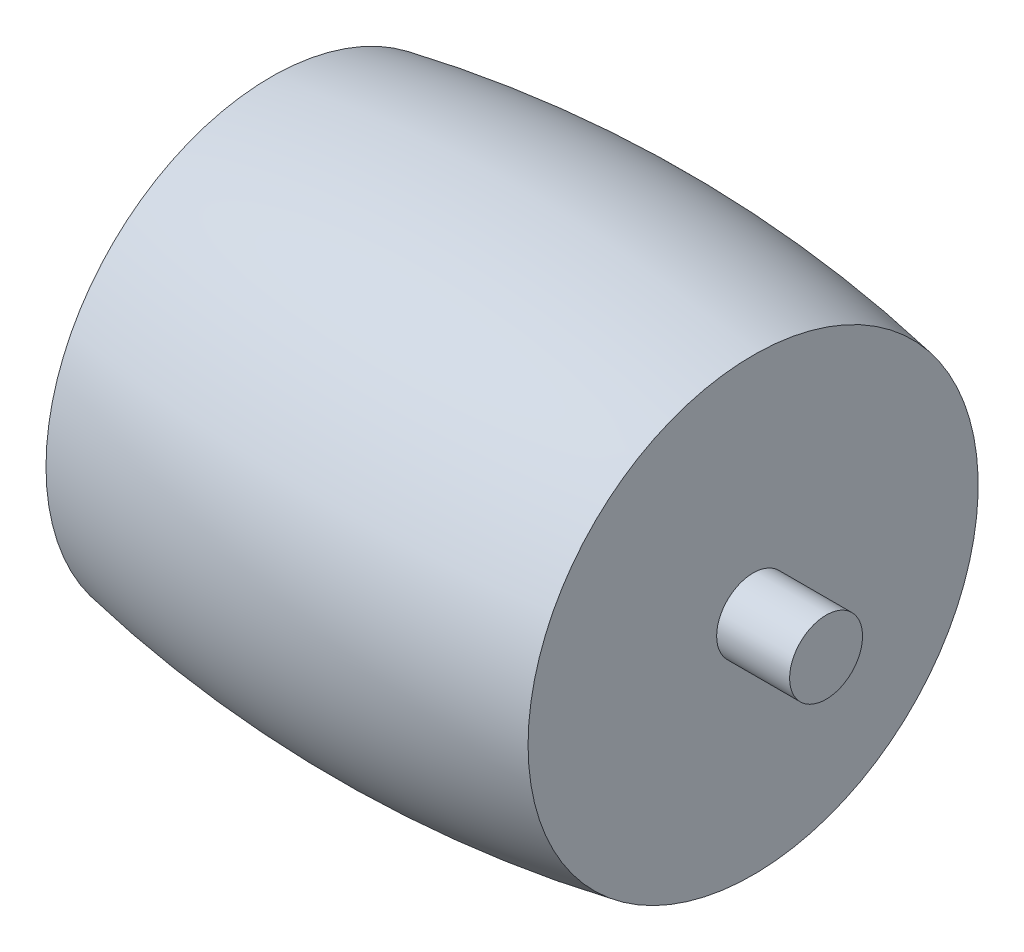
ISO-10303-21;
HEADER;
FILE_DESCRIPTION(('STEP AP214'),'2;1');
FILE_NAME('part.step','',(''),(''),'','','');
FILE_SCHEMA(('AUTOMOTIVE_DESIGN { 1 0 10303 214 1 1 1 1 }'));
ENDSEC;
DATA;
#1=APPLICATION_CONTEXT('core data for automotive mechanical design processes');
#2=APPLICATION_PROTOCOL_DEFINITION('international standard','automotive_design',2000,#1);
#3=PRODUCT_CONTEXT('',#1,'mechanical');
#4=PRODUCT('Part','Part','',(#3));
#5=PRODUCT_RELATED_PRODUCT_CATEGORY('part','',(#4));
#6=PRODUCT_DEFINITION_FORMATION('','',#4);
#7=PRODUCT_DEFINITION_CONTEXT('part definition',#1,'design');
#8=PRODUCT_DEFINITION('design','',#6,#7);
#9=PRODUCT_DEFINITION_SHAPE('','',#8);
#10=(LENGTH_UNIT() NAMED_UNIT(*) SI_UNIT(.MILLI.,.METRE.));
#11=(NAMED_UNIT(*) PLANE_ANGLE_UNIT() SI_UNIT($,.RADIAN.));
#12=(NAMED_UNIT(*) SI_UNIT($,.STERADIAN.) SOLID_ANGLE_UNIT());
#13=UNCERTAINTY_MEASURE_WITH_UNIT(LENGTH_MEASURE(1.E-05),#10,'distance_accuracy_value','');
#14=(GEOMETRIC_REPRESENTATION_CONTEXT(3) GLOBAL_UNCERTAINTY_ASSIGNED_CONTEXT((#13)) GLOBAL_UNIT_ASSIGNED_CONTEXT((#10,
#11,#12)) REPRESENTATION_CONTEXT('',''));
#15=CARTESIAN_POINT('',(0.,0.,0.));
#16=DIRECTION('',(0.,0.,1.));
#17=DIRECTION('',(1.,0.,0.));
#18=AXIS2_PLACEMENT_3D('',#15,#16,#17);
#19=CARTESIAN_POINT('',(-5.83152173913043,25.5326086956522,0.));
#20=DIRECTION('',(-1.,0.,0.));
#21=DIRECTION('',(0.,0.,1.));
#22=AXIS2_PLACEMENT_3D('',#19,#20,#21);
#23=CYLINDRICAL_SURFACE('',#22,0.88260869565216);
#24=CARTESIAN_POINT('',(5.83152173913043,25.5326086956522,0.));
#25=DIRECTION('',(-1.,0.,0.));
#26=DIRECTION('',(0.,0.,1.));
#27=AXIS2_PLACEMENT_3D('',#24,#25,#26);
#28=CIRCLE('',#27,0.88260869565216);
#29=CARTESIAN_POINT('',(5.83152173913043,25.5326086956522,0.88260869565216));
#30=VERTEX_POINT('',#29);
#31=EDGE_CURVE('E10',#30,#30,#28,.T.);
#32=ORIENTED_EDGE('',*,*,#31,.F.);
#33=EDGE_LOOP('',(#32));
#34=FACE_BOUND('',#33,.T.);
#35=CARTESIAN_POINT('',(7.59673913043478,25.5326086956522,0.));
#36=DIRECTION('',(-1.,0.,0.));
#37=DIRECTION('',(0.,0.,1.));
#38=AXIS2_PLACEMENT_3D('',#35,#36,#37);
#39=CIRCLE('',#38,0.88260869565216);
#40=CARTESIAN_POINT('',(7.59673913043478,25.5326086956522,0.88260869565216));
#41=VERTEX_POINT('',#40);
#42=EDGE_CURVE('E64',#41,#41,#39,.T.);
#43=ORIENTED_EDGE('',*,*,#42,.T.);
#44=EDGE_LOOP('',(#43));
#45=FACE_BOUND('',#44,.T.);
#46=ADVANCED_FACE('F37',(#34,#45),#23,.T.);
#47=CARTESIAN_POINT('',(5.83152173913043,30.9776272818502,0.));
#48=DIRECTION('',(-1.,0.,0.));
#49=DIRECTION('',(0.,0.,1.));
#50=AXIS2_PLACEMENT_3D('',#47,#48,#49);
#51=PLANE('',#50);
#52=CARTESIAN_POINT('',(5.83152173913044,25.5326086956522,0.));
#53=DIRECTION('',(-1.,0.,0.));
#54=DIRECTION('',(0.,0.,1.));
#55=AXIS2_PLACEMENT_3D('',#52,#53,#54);
#56=CIRCLE('',#55,5.44501858619806);
#57=CARTESIAN_POINT('',(5.83152173913044,25.5326086956522,5.44501858619806));
#58=VERTEX_POINT('',#57);
#59=EDGE_CURVE('E44',#58,#58,#56,.T.);
#60=ORIENTED_EDGE('',*,*,#59,.F.);
#61=EDGE_LOOP('',(#60));
#62=FACE_BOUND('',#61,.T.);
#63=ORIENTED_EDGE('',*,*,#31,.T.);
#64=EDGE_LOOP('',(#63));
#65=FACE_BOUND('',#64,.T.);
#66=ADVANCED_FACE('F81',(#62,#65),#51,.F.);
#67=CARTESIAN_POINT('',(0.,25.5326086956522,0.));
#68=DIRECTION('',(-1.,0.,0.));
#69=DIRECTION('',(0.,0.,1.));
#70=AXIS2_PLACEMENT_3D('',#67,#68,#69);
#71=DEGENERATE_TOROIDAL_SURFACE('',#70,25.5326086956522,31.5217391304348,.F.);
#72=CARTESIAN_POINT('',(-5.83152173913044,25.5326086956522,0.));
#73=DIRECTION('',(-1.,0.,0.));
#74=DIRECTION('',(0.,0.,1.));
#75=AXIS2_PLACEMENT_3D('',#72,#73,#74);
#76=CIRCLE('',#75,5.44501858619806);
#77=CARTESIAN_POINT('',(-5.83152173913044,25.5326086956522,5.44501858619806));
#78=VERTEX_POINT('',#77);
#79=EDGE_CURVE('E49',#78,#78,#76,.T.);
#80=ORIENTED_EDGE('',*,*,#79,.F.);
#81=EDGE_LOOP('',(#80));
#82=FACE_BOUND('',#81,.T.);
#83=ORIENTED_EDGE('',*,*,#59,.T.);
#84=EDGE_LOOP('',(#83));
#85=FACE_BOUND('',#84,.T.);
#86=ADVANCED_FACE('F86',(#82,#85),#71,.F.);
#87=CARTESIAN_POINT('',(-5.83152173913044,30.9776272818502,0.));
#88=DIRECTION('',(1.,0.,0.));
#89=DIRECTION('',(0.,0.,-1.));
#90=AXIS2_PLACEMENT_3D('',#87,#88,#89);
#91=PLANE('',#90);
#92=CARTESIAN_POINT('',(-5.83152173913044,25.5326086956522,0.));
#93=DIRECTION('',(-1.,0.,0.));
#94=DIRECTION('',(0.,0.,1.));
#95=AXIS2_PLACEMENT_3D('',#92,#93,#94);
#96=CIRCLE('',#95,0.88260869565216);
#97=CARTESIAN_POINT('',(-5.83152173913044,25.5326086956522,0.88260869565216));
#98=VERTEX_POINT('',#97);
#99=EDGE_CURVE('E54',#98,#98,#96,.T.);
#100=ORIENTED_EDGE('',*,*,#99,.F.);
#101=EDGE_LOOP('',(#100));
#102=FACE_BOUND('',#101,.T.);
#103=ORIENTED_EDGE('',*,*,#79,.T.);
#104=EDGE_LOOP('',(#103));
#105=FACE_BOUND('',#104,.T.);
#106=ADVANCED_FACE('F91',(#102,#105),#91,.F.);
#107=CARTESIAN_POINT('',(-5.83152173913043,25.5326086956522,0.));
#108=DIRECTION('',(-1.,0.,0.));
#109=DIRECTION('',(0.,0.,1.));
#110=AXIS2_PLACEMENT_3D('',#107,#108,#109);
#111=CYLINDRICAL_SURFACE('',#110,0.88260869565216);
#112=CARTESIAN_POINT('',(-7.59673913043478,25.5326086956522,0.));
#113=DIRECTION('',(-1.,0.,0.));
#114=DIRECTION('',(0.,0.,1.));
#115=AXIS2_PLACEMENT_3D('',#112,#113,#114);
#116=CIRCLE('',#115,0.88260869565216);
#117=CARTESIAN_POINT('',(-7.59673913043478,25.5326086956522,0.88260869565216));
#118=VERTEX_POINT('',#117);
#119=EDGE_CURVE('E60',#118,#118,#116,.T.);
#120=ORIENTED_EDGE('',*,*,#119,.F.);
#121=EDGE_LOOP('',(#120));
#122=FACE_BOUND('',#121,.T.);
#123=ORIENTED_EDGE('',*,*,#99,.T.);
#124=EDGE_LOOP('',(#123));
#125=FACE_BOUND('',#124,.T.);
#126=ADVANCED_FACE('F77',(#122,#125),#111,.T.);
#127=CARTESIAN_POINT('',(-7.59673913043478,26.4152173913043,0.));
#128=DIRECTION('',(1.,0.,0.));
#129=DIRECTION('',(0.,0.,-1.));
#130=AXIS2_PLACEMENT_3D('',#127,#128,#129);
#131=PLANE('',#130);
#132=ORIENTED_EDGE('',*,*,#119,.T.);
#133=EDGE_LOOP('',(#132));
#134=FACE_BOUND('',#133,.T.);
#135=ADVANCED_FACE('F72',(#134),#131,.F.);
#136=CARTESIAN_POINT('',(7.59673913043478,26.4152173913043,0.));
#137=DIRECTION('',(-1.,0.,0.));
#138=DIRECTION('',(0.,0.,1.));
#139=AXIS2_PLACEMENT_3D('',#136,#137,#138);
#140=PLANE('',#139);
#141=ORIENTED_EDGE('',*,*,#42,.F.);
#142=EDGE_LOOP('',(#141));
#143=FACE_BOUND('',#142,.T.);
#144=ADVANCED_FACE('F70',(#143),#140,.F.);
#145=CLOSED_SHELL('',(#46,#66,#86,#106,#126,#135,#144));
#146=MANIFOLD_SOLID_BREP('B2',#145);
#147=ADVANCED_BREP_SHAPE_REPRESENTATION('',(#18,#146),#14);
#148=SHAPE_DEFINITION_REPRESENTATION(#9,#147);
ENDSEC;
END-ISO-10303-21;
